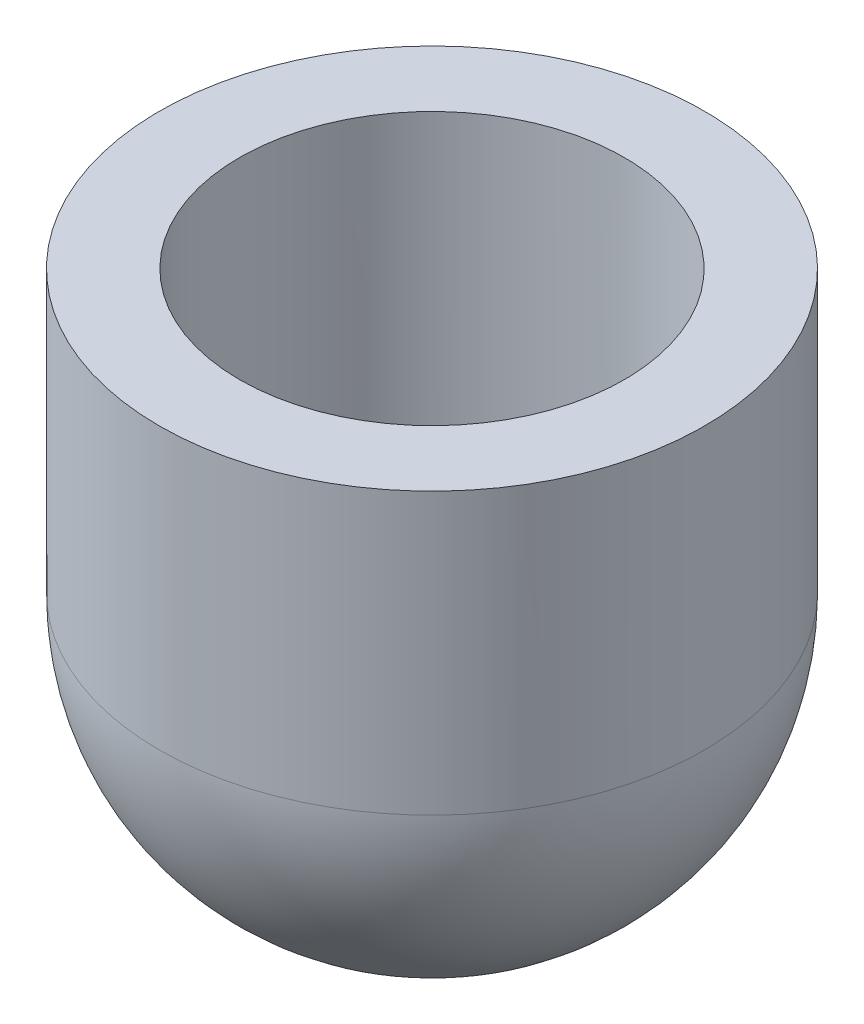
ISO-10303-21;
HEADER;
FILE_DESCRIPTION(('STEP AP214'),'2;1');
FILE_NAME('part.step','',(''),(''),'','','');
FILE_SCHEMA(('AUTOMOTIVE_DESIGN { 1 0 10303 214 1 1 1 1 }'));
ENDSEC;
DATA;
#1=APPLICATION_CONTEXT('core data for automotive mechanical design processes');
#2=APPLICATION_PROTOCOL_DEFINITION('international standard','automotive_design',2000,#1);
#3=PRODUCT_CONTEXT('',#1,'mechanical');
#4=PRODUCT('Part','Part','',(#3));
#5=PRODUCT_RELATED_PRODUCT_CATEGORY('part','',(#4));
#6=PRODUCT_DEFINITION_FORMATION('','',#4);
#7=PRODUCT_DEFINITION_CONTEXT('part definition',#1,'design');
#8=PRODUCT_DEFINITION('design','',#6,#7);
#9=PRODUCT_DEFINITION_SHAPE('','',#8);
#10=(LENGTH_UNIT() NAMED_UNIT(*) SI_UNIT(.MILLI.,.METRE.));
#11=(NAMED_UNIT(*) PLANE_ANGLE_UNIT() SI_UNIT($,.RADIAN.));
#12=(NAMED_UNIT(*) SI_UNIT($,.STERADIAN.) SOLID_ANGLE_UNIT());
#13=UNCERTAINTY_MEASURE_WITH_UNIT(LENGTH_MEASURE(1.E-05),#10,'distance_accuracy_value','');
#14=(GEOMETRIC_REPRESENTATION_CONTEXT(3) GLOBAL_UNCERTAINTY_ASSIGNED_CONTEXT((#13)) GLOBAL_UNIT_ASSIGNED_CONTEXT((#10,
#11,#12)) REPRESENTATION_CONTEXT('',''));
#15=CARTESIAN_POINT('',(0.,0.,0.));
#16=DIRECTION('',(0.,0.,1.));
#17=DIRECTION('',(1.,0.,0.));
#18=AXIS2_PLACEMENT_3D('',#15,#16,#17);
#19=CARTESIAN_POINT('',(0.,26.3768986387821,0.));
#20=DIRECTION('',(0.,1.,0.));
#21=DIRECTION('',(0.,0.,1.));
#22=AXIS2_PLACEMENT_3D('',#19,#20,#21);
#23=CYLINDRICAL_SURFACE('',#22,8.636);
#24=CARTESIAN_POINT('',(0.,0.,0.));
#25=DIRECTION('',(0.,1.,0.));
#26=DIRECTION('',(0.,0.,1.));
#27=AXIS2_PLACEMENT_3D('',#24,#25,#26);
#28=CIRCLE('',#27,8.636);
#29=CARTESIAN_POINT('',(0.,0.,8.636));
#30=VERTEX_POINT('',#29);
#31=EDGE_CURVE('E44',#30,#30,#28,.T.);
#32=ORIENTED_EDGE('',*,*,#31,.F.);
#33=EDGE_LOOP('',(#32));
#34=FACE_BOUND('',#33,.T.);
#35=CARTESIAN_POINT('',(0.,-8.89,0.));
#36=DIRECTION('',(0.,1.,0.));
#37=DIRECTION('',(0.,0.,1.));
#38=AXIS2_PLACEMENT_3D('',#35,#36,#37);
#39=CIRCLE('',#38,8.636);
#40=CARTESIAN_POINT('',(0.,-8.89,8.636));
#41=VERTEX_POINT('',#40);
#42=EDGE_CURVE('E10',#41,#41,#39,.T.);
#43=ORIENTED_EDGE('',*,*,#42,.T.);
#44=EDGE_LOOP('',(#43));
#45=FACE_BOUND('',#44,.T.);
#46=ADVANCED_FACE('F30',(#34,#45),#23,.T.);
#47=CARTESIAN_POINT('',(0.,-8.89,0.));
#48=DIRECTION('',(0.,1.,0.));
#49=DIRECTION('',(0.,0.,-1.));
#50=AXIS2_PLACEMENT_3D('',#47,#48,#49);
#51=SPHERICAL_SURFACE('',#50,8.636);
#52=ORIENTED_EDGE('',*,*,#42,.F.);
#53=EDGE_LOOP('',(#52));
#54=FACE_BOUND('',#53,.T.);
#55=ADVANCED_FACE('F53',(#54),#51,.T.);
#56=CARTESIAN_POINT('',(0.,-8.89,0.));
#57=DIRECTION('',(0.,1.,0.));
#58=DIRECTION('',(0.,0.,-1.));
#59=AXIS2_PLACEMENT_3D('',#56,#57,#58);
#60=SPHERICAL_SURFACE('',#59,6.096);
#61=CARTESIAN_POINT('',(0.,-8.89,0.));
#62=DIRECTION('',(0.,1.,0.));
#63=DIRECTION('',(0.,0.,1.));
#64=AXIS2_PLACEMENT_3D('',#61,#62,#63);
#65=CIRCLE('',#64,6.096);
#66=CARTESIAN_POINT('',(0.,-8.89,6.096));
#67=VERTEX_POINT('',#66);
#68=EDGE_CURVE('E36',#67,#67,#65,.T.);
#69=ORIENTED_EDGE('',*,*,#68,.T.);
#70=EDGE_LOOP('',(#69));
#71=FACE_BOUND('',#70,.T.);
#72=ADVANCED_FACE('F57',(#71),#60,.F.);
#73=CARTESIAN_POINT('',(0.,26.3768986387821,0.));
#74=DIRECTION('',(0.,1.,0.));
#75=DIRECTION('',(0.,0.,1.));
#76=AXIS2_PLACEMENT_3D('',#73,#74,#75);
#77=CYLINDRICAL_SURFACE('',#76,6.096);
#78=ORIENTED_EDGE('',*,*,#68,.F.);
#79=EDGE_LOOP('',(#78));
#80=FACE_BOUND('',#79,.T.);
#81=CARTESIAN_POINT('',(0.,0.,0.));
#82=DIRECTION('',(0.,1.,0.));
#83=DIRECTION('',(0.,0.,1.));
#84=AXIS2_PLACEMENT_3D('',#81,#82,#83);
#85=CIRCLE('',#84,6.096);
#86=CARTESIAN_POINT('',(0.,0.,6.096));
#87=VERTEX_POINT('',#86);
#88=EDGE_CURVE('E40',#87,#87,#85,.T.);
#89=ORIENTED_EDGE('',*,*,#88,.T.);
#90=EDGE_LOOP('',(#89));
#91=FACE_BOUND('',#90,.T.);
#92=ADVANCED_FACE('F62',(#80,#91),#77,.F.);
#93=CARTESIAN_POINT('',(0.,0.,-8.636));
#94=DIRECTION('',(0.,-1.,0.));
#95=DIRECTION('',(0.,0.,-1.));
#96=AXIS2_PLACEMENT_3D('',#93,#94,#95);
#97=PLANE('',#96);
#98=ORIENTED_EDGE('',*,*,#88,.F.);
#99=EDGE_LOOP('',(#98));
#100=FACE_BOUND('',#99,.T.);
#101=ORIENTED_EDGE('',*,*,#31,.T.);
#102=EDGE_LOOP('',(#101));
#103=FACE_BOUND('',#102,.T.);
#104=ADVANCED_FACE('F50',(#100,#103),#97,.F.);
#105=CLOSED_SHELL('',(#46,#55,#72,#92,#104));
#106=MANIFOLD_SOLID_BREP('B2',#105);
#107=ADVANCED_BREP_SHAPE_REPRESENTATION('',(#18,#106),#14);
#108=SHAPE_DEFINITION_REPRESENTATION(#9,#107);
ENDSEC;
END-ISO-10303-21;
